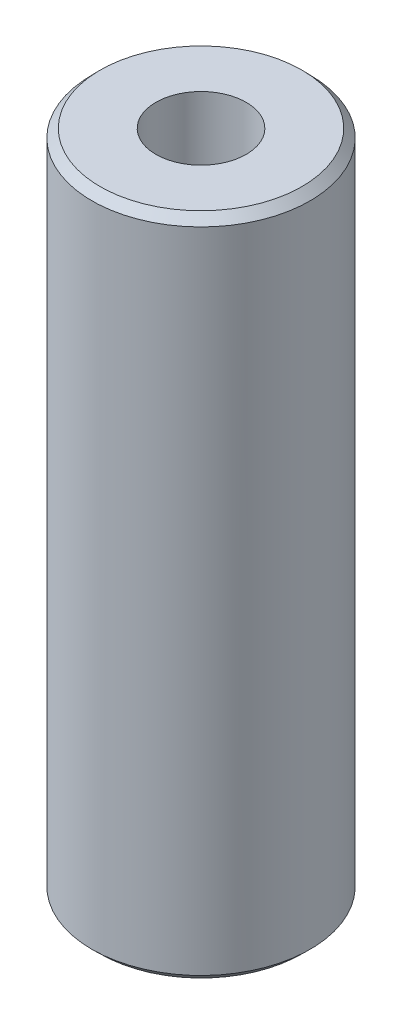
ISO-10303-21;
HEADER;
FILE_DESCRIPTION(('STEP AP214'),'2;1');
FILE_NAME('part.step','',(''),(''),'','','');
FILE_SCHEMA(('AUTOMOTIVE_DESIGN { 1 0 10303 214 1 1 1 1 }'));
ENDSEC;
DATA;
#1=APPLICATION_CONTEXT('core data for automotive mechanical design processes');
#2=APPLICATION_PROTOCOL_DEFINITION('international standard','automotive_design',2000,#1);
#3=PRODUCT_CONTEXT('',#1,'mechanical');
#4=PRODUCT('Part','Part','',(#3));
#5=PRODUCT_RELATED_PRODUCT_CATEGORY('part','',(#4));
#6=PRODUCT_DEFINITION_FORMATION('','',#4);
#7=PRODUCT_DEFINITION_CONTEXT('part definition',#1,'design');
#8=PRODUCT_DEFINITION('design','',#6,#7);
#9=PRODUCT_DEFINITION_SHAPE('','',#8);
#10=(LENGTH_UNIT() NAMED_UNIT(*) SI_UNIT(.MILLI.,.METRE.));
#11=(NAMED_UNIT(*) PLANE_ANGLE_UNIT() SI_UNIT($,.RADIAN.));
#12=(NAMED_UNIT(*) SI_UNIT($,.STERADIAN.) SOLID_ANGLE_UNIT());
#13=UNCERTAINTY_MEASURE_WITH_UNIT(LENGTH_MEASURE(1.E-05),#10,'distance_accuracy_value','');
#14=(GEOMETRIC_REPRESENTATION_CONTEXT(3) GLOBAL_UNCERTAINTY_ASSIGNED_CONTEXT((#13)) GLOBAL_UNIT_ASSIGNED_CONTEXT((#10,
#11,#12)) REPRESENTATION_CONTEXT('',''));
#15=CARTESIAN_POINT('',(0.,0.,0.));
#16=DIRECTION('',(0.,0.,1.));
#17=DIRECTION('',(1.,0.,0.));
#18=AXIS2_PLACEMENT_3D('',#15,#16,#17);
#19=CARTESIAN_POINT('',(0.,121.924233264143,0.));
#20=DIRECTION('',(0.,-1.,0.));
#21=DIRECTION('',(0.,0.,-1.));
#22=AXIS2_PLACEMENT_3D('',#19,#20,#21);
#23=CYLINDRICAL_SURFACE('',#22,20.);
#24=CARTESIAN_POINT('',(0.,120.399299197197,0.));
#25=DIRECTION('',(0.,1.,0.));
#26=DIRECTION('',(0.,0.,1.));
#27=AXIS2_PLACEMENT_3D('',#24,#25,#26);
#28=CIRCLE('',#27,20.);
#29=CARTESIAN_POINT('',(0.,120.399299197197,-20.));
#30=VERTEX_POINT('',#29);
#31=EDGE_CURVE('E50',#30,#30,#28,.F.);
#32=ORIENTED_EDGE('',*,*,#31,.T.);
#33=EDGE_LOOP('',(#32));
#34=FACE_BOUND('',#33,.T.);
#35=CARTESIAN_POINT('',(0.,1.48477769318869,0.));
#36=DIRECTION('',(0.,1.,0.));
#37=DIRECTION('',(0.,0.,1.));
#38=AXIS2_PLACEMENT_3D('',#35,#36,#37);
#39=CIRCLE('',#38,20.);
#40=CARTESIAN_POINT('',(0.,1.48477769318869,20.));
#41=VERTEX_POINT('',#40);
#42=EDGE_CURVE('E51',#41,#41,#39,.T.);
#43=ORIENTED_EDGE('',*,*,#42,.T.);
#44=EDGE_LOOP('',(#43));
#45=FACE_BOUND('',#44,.T.);
#46=ADVANCED_FACE('F39',(#34,#45),#23,.T.);
#47=CARTESIAN_POINT('',(0.,121.924233264143,0.));
#48=DIRECTION('',(0.,1.,0.));
#49=DIRECTION('',(0.,0.,1.));
#50=AXIS2_PLACEMENT_3D('',#47,#48,#49);
#51=PLANE('',#50);
#52=CARTESIAN_POINT('',(0.,121.924233264143,0.));
#53=DIRECTION('',(0.,1.,0.));
#54=DIRECTION('',(0.,0.,1.));
#55=AXIS2_PLACEMENT_3D('',#52,#53,#54);
#56=CIRCLE('',#55,18.5152223068113);
#57=CARTESIAN_POINT('',(0.,121.924233264143,-18.5152223068113));
#58=VERTEX_POINT('',#57);
#59=EDGE_CURVE('E54',#58,#58,#56,.T.);
#60=ORIENTED_EDGE('',*,*,#59,.T.);
#61=EDGE_LOOP('',(#60));
#62=FACE_BOUND('',#61,.T.);
#63=CARTESIAN_POINT('',(0.,121.924233264143,0.));
#64=DIRECTION('',(0.,1.,0.));
#65=DIRECTION('',(0.,0.,1.));
#66=AXIS2_PLACEMENT_3D('',#63,#64,#65);
#67=CIRCLE('',#66,8.28420737334767);
#68=CARTESIAN_POINT('',(0.,121.924233264143,8.28420737334767));
#69=VERTEX_POINT('',#68);
#70=EDGE_CURVE('E58',#69,#69,#67,.T.);
#71=ORIENTED_EDGE('',*,*,#70,.F.);
#72=EDGE_LOOP('',(#71));
#73=FACE_BOUND('',#72,.T.);
#74=ADVANCED_FACE('F69',(#62,#73),#51,.T.);
#75=CARTESIAN_POINT('',(0.,0.,0.));
#76=DIRECTION('',(0.,1.,0.));
#77=DIRECTION('',(0.,0.,1.));
#78=AXIS2_PLACEMENT_3D('',#75,#76,#77);
#79=PLANE('',#78);
#80=CARTESIAN_POINT('',(0.,0.,0.));
#81=DIRECTION('',(0.,1.,0.));
#82=DIRECTION('',(0.,0.,1.));
#83=AXIS2_PLACEMENT_3D('',#80,#81,#82);
#84=CIRCLE('',#83,18.4750659330537);
#85=CARTESIAN_POINT('',(0.,0.,18.4750659330537));
#86=VERTEX_POINT('',#85);
#87=EDGE_CURVE('E10',#86,#86,#84,.F.);
#88=ORIENTED_EDGE('',*,*,#87,.T.);
#89=EDGE_LOOP('',(#88));
#90=FACE_BOUND('',#89,.T.);
#91=CARTESIAN_POINT('',(0.,0.,0.));
#92=DIRECTION('',(0.,1.,0.));
#93=DIRECTION('',(0.,0.,1.));
#94=AXIS2_PLACEMENT_3D('',#91,#92,#93);
#95=CIRCLE('',#94,8.28420737334767);
#96=CARTESIAN_POINT('',(0.,0.,8.28420737334767));
#97=VERTEX_POINT('',#96);
#98=EDGE_CURVE('E63',#97,#97,#95,.T.);
#99=ORIENTED_EDGE('',*,*,#98,.T.);
#100=EDGE_LOOP('',(#99));
#101=FACE_BOUND('',#100,.T.);
#102=ADVANCED_FACE('F75',(#90,#101),#79,.F.);
#103=CARTESIAN_POINT('',(0.,121.924233264143,0.));
#104=DIRECTION('',(0.,-1.,0.));
#105=DIRECTION('',(0.,0.,-1.));
#106=AXIS2_PLACEMENT_3D('',#103,#104,#105);
#107=CYLINDRICAL_SURFACE('',#106,8.28420737334767);
#108=ORIENTED_EDGE('',*,*,#70,.T.);
#109=EDGE_LOOP('',(#108));
#110=FACE_BOUND('',#109,.T.);
#111=ORIENTED_EDGE('',*,*,#98,.F.);
#112=EDGE_LOOP('',(#111));
#113=FACE_BOUND('',#112,.T.);
#114=ADVANCED_FACE('F70',(#110,#113),#107,.F.);
#115=CARTESIAN_POINT('',(0.,121.924233264143,0.));
#116=DIRECTION('',(0.,-1.,0.));
#117=DIRECTION('',(0.,0.,-1.));
#118=AXIS2_PLACEMENT_3D('',#115,#116,#117);
#119=CONICAL_SURFACE('',#118,18.5152223068113,0.772056689400645);
#120=CARTESIAN_POINT('',(0.,120.399299197197,-20.));
#121=CARTESIAN_POINT('',(0.,120.415183927061,-19.984533565696));
#122=CARTESIAN_POINT('',(0.,120.431068656925,-19.9690671313919));
#123=CARTESIAN_POINT('',(0.,120.462838116653,-19.9381342627838));
#124=CARTESIAN_POINT('',(0.,120.478722846517,-19.9226678284798));
#125=CARTESIAN_POINT('',(0.,120.510492306245,-19.8917349598717));
#126=CARTESIAN_POINT('',(0.,120.526377036109,-19.8762685255676));
#127=CARTESIAN_POINT('',(0.,120.558146495837,-19.8453356569595));
#128=CARTESIAN_POINT('',(0.,120.574031225701,-19.8298692226555));
#129=CARTESIAN_POINT('',(0.,120.605800685429,-19.7989363540474));
#130=CARTESIAN_POINT('',(0.,120.621685415293,-19.7834699197433));
#131=CARTESIAN_POINT('',(0.,120.653454875021,-19.7525370511352));
#132=CARTESIAN_POINT('',(0.,120.669339604885,-19.7370706168312));
#133=CARTESIAN_POINT('',(0.,120.701109064613,-19.7061377482231));
#134=CARTESIAN_POINT('',(0.,120.716993794477,-19.690671313919));
#135=CARTESIAN_POINT('',(0.,120.748763254205,-19.6597384453109));
#136=CARTESIAN_POINT('',(0.,120.764647984069,-19.6442720110069));
#137=CARTESIAN_POINT('',(0.,120.796417443797,-19.6133391423988));
#138=CARTESIAN_POINT('',(0.,120.812302173661,-19.5978727080947));
#139=CARTESIAN_POINT('',(0.,120.844071633389,-19.5669398394866));
#140=CARTESIAN_POINT('',(0.,120.859956363253,-19.5514734051826));
#141=CARTESIAN_POINT('',(0.,120.891725822981,-19.5205405365745));
#142=CARTESIAN_POINT('',(0.,120.907610552845,-19.5050741022704));
#143=CARTESIAN_POINT('',(0.,120.939380012573,-19.4741412336623));
#144=CARTESIAN_POINT('',(0.,120.955264742437,-19.4586747993583));
#145=CARTESIAN_POINT('',(0.,120.987034202165,-19.4277419307502));
#146=CARTESIAN_POINT('',(0.,121.002918932029,-19.4122754964461));
#147=CARTESIAN_POINT('',(0.,121.034688391758,-19.381342627838));
#148=CARTESIAN_POINT('',(0.,121.050573121622,-19.365876193534));
#149=CARTESIAN_POINT('',(0.,121.08234258135,-19.3349433249259));
#150=CARTESIAN_POINT('',(0.,121.098227311214,-19.3194768906219));
#151=CARTESIAN_POINT('',(0.,121.129996770942,-19.2885440220138));
#152=CARTESIAN_POINT('',(0.,121.145881500806,-19.2730775877097));
#153=CARTESIAN_POINT('',(0.,121.177650960534,-19.2421447191016));
#154=CARTESIAN_POINT('',(0.,121.193535690398,-19.2266782847976));
#155=CARTESIAN_POINT('',(0.,121.225305150126,-19.1957454161895));
#156=CARTESIAN_POINT('',(0.,121.24118987999,-19.1802789818854));
#157=CARTESIAN_POINT('',(0.,121.272959339718,-19.1493461132773));
#158=CARTESIAN_POINT('',(0.,121.288844069582,-19.1338796789733));
#159=CARTESIAN_POINT('',(0.,121.32061352931,-19.1029468103652));
#160=CARTESIAN_POINT('',(0.,121.336498259174,-19.0874803760611));
#161=CARTESIAN_POINT('',(0.,121.368267718902,-19.056547507453));
#162=CARTESIAN_POINT('',(0.,121.384152448766,-19.041081073149));
#163=CARTESIAN_POINT('',(0.,121.415921908494,-19.0101482045409));
#164=CARTESIAN_POINT('',(0.,121.431806638358,-18.9946817702368));
#165=CARTESIAN_POINT('',(0.,121.463576098086,-18.9637489016287));
#166=CARTESIAN_POINT('',(0.,121.47946082795,-18.9482824673247));
#167=CARTESIAN_POINT('',(0.,121.511230287678,-18.9173495987166));
#168=CARTESIAN_POINT('',(0.,121.527115017542,-18.9018831644125));
#169=CARTESIAN_POINT('',(0.,121.55888447727,-18.8709502958044));
#170=CARTESIAN_POINT('',(0.,121.574769207134,-18.8554838615004));
#171=CARTESIAN_POINT('',(0.,121.606538666862,-18.8245509928923));
#172=CARTESIAN_POINT('',(0.,121.622423396726,-18.8090845585882));
#173=CARTESIAN_POINT('',(0.,121.654192856454,-18.7781516899801));
#174=CARTESIAN_POINT('',(0.,121.670077586318,-18.7626852556761));
#175=CARTESIAN_POINT('',(0.,121.701847046047,-18.731752387068));
#176=CARTESIAN_POINT('',(0.,121.717731775911,-18.7162859527639));
#177=CARTESIAN_POINT('',(0.,121.749501235639,-18.6853530841558));
#178=CARTESIAN_POINT('',(0.,121.765385965503,-18.6698866498518));
#179=CARTESIAN_POINT('',(0.,121.797155425231,-18.6389537812437));
#180=CARTESIAN_POINT('',(0.,121.813040155095,-18.6234873469396));
#181=CARTESIAN_POINT('',(0.,121.844809614823,-18.5925544783316));
#182=CARTESIAN_POINT('',(0.,121.860694344687,-18.5770880440275));
#183=CARTESIAN_POINT('',(0.,121.892463804415,-18.5461551754194));
#184=CARTESIAN_POINT('',(0.,121.908348534279,-18.5306887411153));
#185=CARTESIAN_POINT('',(0.,121.924233264143,-18.5152223068113));
#186=B_SPLINE_CURVE_WITH_KNOTS('',3,(#120,#121,#122,#123,#124,#125,#126,#127,#128,#129,#130,
#131,#132,#133,#134,#135,#136,#137,#138,#139,#140,#141,#142,#143,#144,#145,#146,#147,#148,#149,
#150,#151,#152,#153,#154,#155,#156,#157,#158,#159,#160,#161,#162,#163,#164,#165,#166,#167,#168,
#169,#170,#171,#172,#173,#174,#175,#176,#177,#178,#179,#180,#181,#182,#183,#184,#185),
.UNSPECIFIED.,.F.,.F.,(4,2,2,2,2,2,2,2,2,2,2,2,2,2,2,2,2,2,2,2,2,2,2,2,2,2,2,2,2,2,2,2,4),(0.,
0.0665117816361149,0.133023563272232,0.199535344908347,0.266047126544462,0.33255890818058,
0.399070689816695,0.465582471452809,0.532094253088927,0.598606034725042,0.665117816361157,
0.731629597997274,0.798141379633389,0.864653161269504,0.931164942905622,0.997676724541737,
1.06418850617785,1.13070028781397,1.19721206945008,1.2637238510862,1.33023563272232,
1.39674741435843,1.46325919599455,1.52977097763066,1.59628275926678,1.6627945409029,
1.72930632253901,1.79581810417513,1.86232988581124,1.92884166744736,1.99535344908347,
2.06186523071959,2.12837701235571),.UNSPECIFIED.);
#187=EDGE_CURVE('BSEAM81',#30,#58,#186,.T.);
#188=ORIENTED_EDGE('',*,*,#31,.F.);
#189=ORIENTED_EDGE('',*,*,#59,.F.);
#190=ORIENTED_EDGE('',*,*,#187,.T.);
#191=ORIENTED_EDGE('',*,*,#187,.F.);
#192=EDGE_LOOP('',(#188,#190,#189,#191));
#193=FACE_BOUND('',#192,.T.);
#194=ADVANCED_FACE('F81',(#193),#119,.T.);
#195=CARTESIAN_POINT('',(0.,1.48477769318869,0.));
#196=DIRECTION('',(0.,1.,0.));
#197=DIRECTION('',(0.,0.,1.));
#198=AXIS2_PLACEMENT_3D('',#195,#196,#197);
#199=CONICAL_SURFACE('',#198,20.,0.798739637394254);
#200=ORIENTED_EDGE('',*,*,#87,.F.);
#201=EDGE_LOOP('',(#200));
#202=FACE_BOUND('',#201,.T.);
#203=ORIENTED_EDGE('',*,*,#42,.F.);
#204=EDGE_LOOP('',(#203));
#205=FACE_BOUND('',#204,.T.);
#206=ADVANCED_FACE('F45',(#202,#205),#199,.T.);
#207=CLOSED_SHELL('',(#46,#74,#102,#114,#194,#206));
#208=MANIFOLD_SOLID_BREP('B2',#207);
#209=ADVANCED_BREP_SHAPE_REPRESENTATION('',(#18,#208),#14);
#210=SHAPE_DEFINITION_REPRESENTATION(#9,#209);
ENDSEC;
END-ISO-10303-21;
